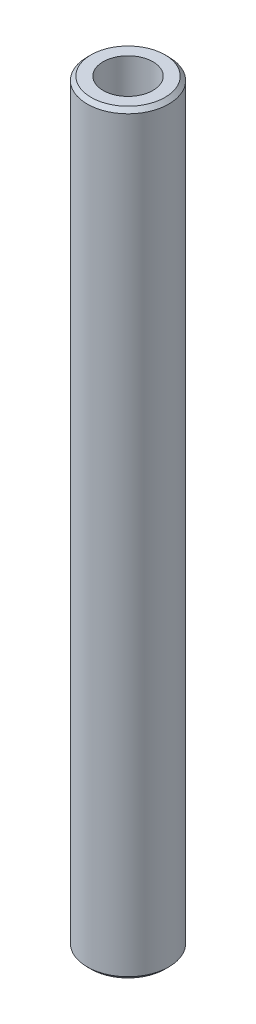
ISO-10303-21;
HEADER;
FILE_DESCRIPTION(('STEP AP214'),'2;1');
FILE_NAME('part.step','',(''),(''),'','','');
FILE_SCHEMA(('AUTOMOTIVE_DESIGN { 1 0 10303 214 1 1 1 1 }'));
ENDSEC;
DATA;
#1=APPLICATION_CONTEXT('core data for automotive mechanical design processes');
#2=APPLICATION_PROTOCOL_DEFINITION('international standard','automotive_design',2000,#1);
#3=PRODUCT_CONTEXT('',#1,'mechanical');
#4=PRODUCT('Part','Part','',(#3));
#5=PRODUCT_RELATED_PRODUCT_CATEGORY('part','',(#4));
#6=PRODUCT_DEFINITION_FORMATION('','',#4);
#7=PRODUCT_DEFINITION_CONTEXT('part definition',#1,'design');
#8=PRODUCT_DEFINITION('design','',#6,#7);
#9=PRODUCT_DEFINITION_SHAPE('','',#8);
#10=(LENGTH_UNIT() NAMED_UNIT(*) SI_UNIT(.MILLI.,.METRE.));
#11=(NAMED_UNIT(*) PLANE_ANGLE_UNIT() SI_UNIT($,.RADIAN.));
#12=(NAMED_UNIT(*) SI_UNIT($,.STERADIAN.) SOLID_ANGLE_UNIT());
#13=UNCERTAINTY_MEASURE_WITH_UNIT(LENGTH_MEASURE(1.E-05),#10,'distance_accuracy_value','');
#14=(GEOMETRIC_REPRESENTATION_CONTEXT(3) GLOBAL_UNCERTAINTY_ASSIGNED_CONTEXT((#13)) GLOBAL_UNIT_ASSIGNED_CONTEXT((#10,
#11,#12)) REPRESENTATION_CONTEXT('',''));
#15=CARTESIAN_POINT('',(0.,0.,0.));
#16=DIRECTION('',(0.,0.,1.));
#17=DIRECTION('',(1.,0.,0.));
#18=AXIS2_PLACEMENT_3D('',#15,#16,#17);
#19=CARTESIAN_POINT('',(0.,416.638164590258,0.));
#20=DIRECTION('',(0.,-1.,0.));
#21=DIRECTION('',(0.,0.,-1.));
#22=AXIS2_PLACEMENT_3D('',#19,#20,#21);
#23=CYLINDRICAL_SURFACE('',#22,22.5);
#24=CARTESIAN_POINT('',(0.,414.516048344697,0.));
#25=DIRECTION('',(0.,1.,0.));
#26=DIRECTION('',(0.,0.,1.));
#27=AXIS2_PLACEMENT_3D('',#24,#25,#26);
#28=CIRCLE('',#27,22.5);
#29=CARTESIAN_POINT('',(0.,414.516048344697,-22.5));
#30=VERTEX_POINT('',#29);
#31=EDGE_CURVE('E50',#30,#30,#28,.F.);
#32=CARTESIAN_POINT('',(0.,2.12211624556136,0.));
#33=DIRECTION('',(0.,1.,0.));
#34=DIRECTION('',(0.,0.,1.));
#35=AXIS2_PLACEMENT_3D('',#32,#33,#34);
#36=CIRCLE('',#35,22.5);
#37=CARTESIAN_POINT('',(0.,2.12211624556136,-22.5));
#38=VERTEX_POINT('',#37);
#39=EDGE_CURVE('E51',#38,#38,#36,.T.);
#40=CARTESIAN_POINT('',(0.,414.516048344697,-22.5));
#41=CARTESIAN_POINT('',(0.,410.220278218664,-22.5));
#42=CARTESIAN_POINT('',(0.,405.924508092632,-22.5));
#43=CARTESIAN_POINT('',(0.,397.332967840566,-22.5));
#44=CARTESIAN_POINT('',(0.,393.037197714534,-22.5));
#45=CARTESIAN_POINT('',(0.,384.445657462468,-22.5));
#46=CARTESIAN_POINT('',(0.,380.149887336436,-22.5));
#47=CARTESIAN_POINT('',(0.,371.55834708437,-22.5));
#48=CARTESIAN_POINT('',(0.,367.262576958338,-22.5));
#49=CARTESIAN_POINT('',(0.,358.671036706272,-22.5));
#50=CARTESIAN_POINT('',(0.,354.37526658024,-22.5));
#51=CARTESIAN_POINT('',(0.,345.783726328174,-22.5));
#52=CARTESIAN_POINT('',(0.,341.487956202142,-22.5));
#53=CARTESIAN_POINT('',(0.,332.896415950076,-22.5));
#54=CARTESIAN_POINT('',(0.,328.600645824044,-22.5));
#55=CARTESIAN_POINT('',(0.,320.009105571978,-22.5));
#56=CARTESIAN_POINT('',(0.,315.713335445946,-22.5));
#57=CARTESIAN_POINT('',(0.,307.12179519388,-22.5));
#58=CARTESIAN_POINT('',(0.,302.826025067848,-22.5));
#59=CARTESIAN_POINT('',(0.,294.234484815782,-22.5));
#60=CARTESIAN_POINT('',(0.,289.93871468975,-22.5));
#61=CARTESIAN_POINT('',(0.,281.347174437684,-22.5));
#62=CARTESIAN_POINT('',(0.,277.051404311652,-22.5));
#63=CARTESIAN_POINT('',(0.,268.459864059586,-22.5));
#64=CARTESIAN_POINT('',(0.,264.164093933554,-22.5));
#65=CARTESIAN_POINT('',(0.,255.572553681488,-22.5));
#66=CARTESIAN_POINT('',(0.,251.276783555456,-22.5));
#67=CARTESIAN_POINT('',(0.,242.685243303391,-22.5));
#68=CARTESIAN_POINT('',(0.,238.389473177358,-22.5));
#69=CARTESIAN_POINT('',(0.,229.797932925292,-22.5));
#70=CARTESIAN_POINT('',(0.,225.50216279926,-22.5));
#71=CARTESIAN_POINT('',(0.,216.910622547195,-22.5));
#72=CARTESIAN_POINT('',(0.,212.614852421162,-22.5));
#73=CARTESIAN_POINT('',(0.,204.023312169097,-22.5));
#74=CARTESIAN_POINT('',(0.,199.727542043064,-22.5));
#75=CARTESIAN_POINT('',(0.,191.136001790999,-22.5));
#76=CARTESIAN_POINT('',(0.,186.840231664966,-22.5));
#77=CARTESIAN_POINT('',(0.,178.248691412901,-22.5));
#78=CARTESIAN_POINT('',(0.,173.952921286868,-22.5));
#79=CARTESIAN_POINT('',(0.,165.361381034803,-22.5));
#80=CARTESIAN_POINT('',(0.,161.06561090877,-22.5));
#81=CARTESIAN_POINT('',(0.,152.474070656705,-22.5));
#82=CARTESIAN_POINT('',(0.,148.178300530672,-22.5));
#83=CARTESIAN_POINT('',(0.,139.586760278607,-22.5));
#84=CARTESIAN_POINT('',(0.,135.290990152574,-22.5));
#85=CARTESIAN_POINT('',(0.,126.699449900509,-22.5));
#86=CARTESIAN_POINT('',(0.,122.403679774476,-22.5));
#87=CARTESIAN_POINT('',(0.,113.812139522411,-22.5));
#88=CARTESIAN_POINT('',(0.,109.516369396378,-22.5));
#89=CARTESIAN_POINT('',(0.,100.924829144313,-22.5));
#90=CARTESIAN_POINT('',(0.,96.6290590182799,-22.5));
#91=CARTESIAN_POINT('',(0.,88.0375187662146,-22.5));
#92=CARTESIAN_POINT('',(0.,83.741748640182,-22.5));
#93=CARTESIAN_POINT('',(0.,75.1502083881167,-22.5));
#94=CARTESIAN_POINT('',(0.,70.854438262084,-22.5));
#95=CARTESIAN_POINT('',(0.,62.2628980100186,-22.5));
#96=CARTESIAN_POINT('',(0.,57.967127883986,-22.5));
#97=CARTESIAN_POINT('',(0.,49.3755876319206,-22.5));
#98=CARTESIAN_POINT('',(0.,45.079817505888,-22.5));
#99=CARTESIAN_POINT('',(0.,36.4882772538226,-22.5));
#100=CARTESIAN_POINT('',(0.,32.19250712779,-22.5));
#101=CARTESIAN_POINT('',(0.,23.6009668757247,-22.5));
#102=CARTESIAN_POINT('',(0.,19.305196749692,-22.5));
#103=CARTESIAN_POINT('',(0.,10.7136564976267,-22.5));
#104=CARTESIAN_POINT('',(0.,6.41788637159402,-22.5));
#105=CARTESIAN_POINT('',(0.,2.12211624556136,-22.5));
#106=B_SPLINE_CURVE_WITH_KNOTS('',3,(#40,#41,#42,#43,#44,#45,#46,#47,#48,#49,#50,#51,#52,#53,
#54,#55,#56,#57,#58,#59,#60,#61,#62,#63,#64,#65,#66,#67,#68,#69,#70,#71,#72,#73,#74,#75,#76,#77,
#78,#79,#80,#81,#82,#83,#84,#85,#86,#87,#88,#89,#90,#91,#92,#93,#94,#95,#96,#97,#98,#99,#100,
#101,#102,#103,#104,#105),.UNSPECIFIED.,.F.,.F.,(4,2,2,2,2,2,2,2,2,2,2,2,2,2,2,2,2,2,2,2,2,2,2,
2,2,2,2,2,2,2,2,2,4),(0.,12.887310378098,25.774620756196,38.661931134294,51.5492415123919,
64.4365518904899,77.3238622685879,90.2111726466859,103.098483024784,115.985793402882,
128.87310378098,141.760414159078,154.647724537176,167.535034915274,180.422345293372,
193.30965567147,206.196966049568,219.084276427666,231.971586805764,244.858897183862,
257.74620756196,270.633517940058,283.520828318156,296.408138696254,309.295449074352,
322.18275945245,335.070069830548,347.957380208646,360.844690586744,373.732000964842,
386.61931134294,399.506621721038,412.393932099136),.UNSPECIFIED.);
#107=EDGE_CURVE('BSEAM39',#30,#38,#106,.T.);
#108=ORIENTED_EDGE('',*,*,#31,.T.);
#109=ORIENTED_EDGE('',*,*,#39,.T.);
#110=ORIENTED_EDGE('',*,*,#107,.T.);
#111=ORIENTED_EDGE('',*,*,#107,.F.);
#112=EDGE_LOOP('',(#108,#110,#109,#111));
#113=FACE_BOUND('',#112,.T.);
#114=ADVANCED_FACE('F39',(#113),#23,.T.);
#115=CARTESIAN_POINT('',(0.,416.638164590258,0.));
#116=DIRECTION('',(0.,1.,0.));
#117=DIRECTION('',(0.,0.,1.));
#118=AXIS2_PLACEMENT_3D('',#115,#116,#117);
#119=PLANE('',#118);
#120=CARTESIAN_POINT('',(0.,416.638164590258,0.));
#121=DIRECTION('',(0.,1.,0.));
#122=DIRECTION('',(0.,0.,1.));
#123=AXIS2_PLACEMENT_3D('',#120,#121,#122);
#124=CIRCLE('',#123,20.3778837544392);
#125=CARTESIAN_POINT('',(0.,416.638164590258,20.3778837544392));
#126=VERTEX_POINT('',#125);
#127=EDGE_CURVE('E54',#126,#126,#124,.T.);
#128=ORIENTED_EDGE('',*,*,#127,.T.);
#129=EDGE_LOOP('',(#128));
#130=FACE_BOUND('',#129,.T.);
#131=CARTESIAN_POINT('',(0.,416.638164590258,0.));
#132=DIRECTION('',(0.,1.,0.));
#133=DIRECTION('',(0.,0.,1.));
#134=AXIS2_PLACEMENT_3D('',#131,#132,#133);
#135=CIRCLE('',#134,13.747466952704);
#136=CARTESIAN_POINT('',(0.,416.638164590258,-13.747466952704));
#137=VERTEX_POINT('',#136);
#138=EDGE_CURVE('E58',#137,#137,#135,.T.);
#139=ORIENTED_EDGE('',*,*,#138,.F.);
#140=EDGE_LOOP('',(#139));
#141=FACE_BOUND('',#140,.T.);
#142=ADVANCED_FACE('F69',(#130,#141),#119,.T.);
#143=CARTESIAN_POINT('',(0.,0.,0.));
#144=DIRECTION('',(0.,1.,0.));
#145=DIRECTION('',(0.,0.,1.));
#146=AXIS2_PLACEMENT_3D('',#143,#144,#145);
#147=PLANE('',#146);
#148=CARTESIAN_POINT('',(0.,0.,0.));
#149=DIRECTION('',(0.,1.,0.));
#150=DIRECTION('',(0.,0.,1.));
#151=AXIS2_PLACEMENT_3D('',#148,#149,#150);
#152=CIRCLE('',#151,20.3778837544386);
#153=CARTESIAN_POINT('',(0.,0.,20.3778837544386));
#154=VERTEX_POINT('',#153);
#155=EDGE_CURVE('E10',#154,#154,#152,.F.);
#156=ORIENTED_EDGE('',*,*,#155,.T.);
#157=EDGE_LOOP('',(#156));
#158=FACE_BOUND('',#157,.T.);
#159=CARTESIAN_POINT('',(0.,0.,0.));
#160=DIRECTION('',(0.,1.,0.));
#161=DIRECTION('',(0.,0.,1.));
#162=AXIS2_PLACEMENT_3D('',#159,#160,#161);
#163=CIRCLE('',#162,13.747466952704);
#164=CARTESIAN_POINT('',(0.,0.,-13.747466952704));
#165=VERTEX_POINT('',#164);
#166=EDGE_CURVE('E63',#165,#165,#163,.T.);
#167=ORIENTED_EDGE('',*,*,#166,.T.);
#168=EDGE_LOOP('',(#167));
#169=FACE_BOUND('',#168,.T.);
#170=ADVANCED_FACE('F75',(#158,#169),#147,.F.);
#171=CARTESIAN_POINT('',(0.,416.638164590258,0.));
#172=DIRECTION('',(0.,-1.,0.));
#173=DIRECTION('',(0.,0.,-1.));
#174=AXIS2_PLACEMENT_3D('',#171,#172,#173);
#175=CYLINDRICAL_SURFACE('',#174,13.747466952704);
#176=CARTESIAN_POINT('',(0.,416.638164590258,-13.747466952704));
#177=CARTESIAN_POINT('',(0.,412.298183709109,-13.747466952704));
#178=CARTESIAN_POINT('',(0.,407.958202827961,-13.747466952704));
#179=CARTESIAN_POINT('',(0.,399.278241065664,-13.747466952704));
#180=CARTESIAN_POINT('',(0.,394.938260184515,-13.747466952704));
#181=CARTESIAN_POINT('',(0.,386.258298422218,-13.747466952704));
#182=CARTESIAN_POINT('',(0.,381.91831754107,-13.747466952704));
#183=CARTESIAN_POINT('',(0.,373.238355778773,-13.747466952704));
#184=CARTESIAN_POINT('',(0.,368.898374897624,-13.747466952704));
#185=CARTESIAN_POINT('',(0.,360.218413135327,-13.747466952704));
#186=CARTESIAN_POINT('',(0.,355.878432254179,-13.747466952704));
#187=CARTESIAN_POINT('',(0.,347.198470491882,-13.747466952704));
#188=CARTESIAN_POINT('',(0.,342.858489610733,-13.747466952704));
#189=CARTESIAN_POINT('',(0.,334.178527848436,-13.747466952704));
#190=CARTESIAN_POINT('',(0.,329.838546967287,-13.747466952704));
#191=CARTESIAN_POINT('',(0.,321.15858520499,-13.747466952704));
#192=CARTESIAN_POINT('',(0.,316.818604323842,-13.747466952704));
#193=CARTESIAN_POINT('',(0.,308.138642561545,-13.747466952704));
#194=CARTESIAN_POINT('',(0.,303.798661680396,-13.747466952704));
#195=CARTESIAN_POINT('',(0.,295.118699918099,-13.747466952704));
#196=CARTESIAN_POINT('',(0.,290.778719036951,-13.747466952704));
#197=CARTESIAN_POINT('',(0.,282.098757274654,-13.747466952704));
#198=CARTESIAN_POINT('',(0.,277.758776393505,-13.747466952704));
#199=CARTESIAN_POINT('',(0.,269.078814631208,-13.747466952704));
#200=CARTESIAN_POINT('',(0.,264.73883375006,-13.747466952704));
#201=CARTESIAN_POINT('',(0.,256.058871987763,-13.747466952704));
#202=CARTESIAN_POINT('',(0.,251.718891106614,-13.747466952704));
#203=CARTESIAN_POINT('',(0.,243.038929344317,-13.747466952704));
#204=CARTESIAN_POINT('',(0.,238.698948463169,-13.747466952704));
#205=CARTESIAN_POINT('',(0.,230.018986700871,-13.747466952704));
#206=CARTESIAN_POINT('',(0.,225.679005819723,-13.747466952704));
#207=CARTESIAN_POINT('',(0.,216.999044057426,-13.747466952704));
#208=CARTESIAN_POINT('',(0.,212.659063176277,-13.747466952704));
#209=CARTESIAN_POINT('',(0.,203.97910141398,-13.747466952704));
#210=CARTESIAN_POINT('',(0.,199.639120532832,-13.747466952704));
#211=CARTESIAN_POINT('',(0.,190.959158770535,-13.747466952704));
#212=CARTESIAN_POINT('',(0.,186.619177889386,-13.747466952704));
#213=CARTESIAN_POINT('',(0.,177.939216127089,-13.747466952704));
#214=CARTESIAN_POINT('',(0.,173.599235245941,-13.747466952704));
#215=CARTESIAN_POINT('',(0.,164.919273483644,-13.747466952704));
#216=CARTESIAN_POINT('',(0.,160.579292602495,-13.747466952704));
#217=CARTESIAN_POINT('',(0.,151.899330840198,-13.747466952704));
#218=CARTESIAN_POINT('',(0.,147.55934995905,-13.747466952704));
#219=CARTESIAN_POINT('',(0.,138.879388196753,-13.747466952704));
#220=CARTESIAN_POINT('',(0.,134.539407315604,-13.747466952704));
#221=CARTESIAN_POINT('',(0.,125.859445553307,-13.747466952704));
#222=CARTESIAN_POINT('',(0.,121.519464672159,-13.747466952704));
#223=CARTESIAN_POINT('',(0.,112.839502909862,-13.747466952704));
#224=CARTESIAN_POINT('',(0.,108.499522028713,-13.747466952704));
#225=CARTESIAN_POINT('',(0.,99.819560266416,-13.747466952704));
#226=CARTESIAN_POINT('',(0.,95.4795793852674,-13.747466952704));
#227=CARTESIAN_POINT('',(0.,86.7996176229704,-13.747466952704));
#228=CARTESIAN_POINT('',(0.,82.4596367418219,-13.747466952704));
#229=CARTESIAN_POINT('',(0.,73.7796749795249,-13.747466952704));
#230=CARTESIAN_POINT('',(0.,69.4396940983763,-13.747466952704));
#231=CARTESIAN_POINT('',(0.,60.7597323360793,-13.747466952704));
#232=CARTESIAN_POINT('',(0.,56.4197514549307,-13.747466952704));
#233=CARTESIAN_POINT('',(0.,47.7397896926337,-13.747466952704));
#234=CARTESIAN_POINT('',(0.,43.3998088114852,-13.747466952704));
#235=CARTESIAN_POINT('',(0.,34.7198470491882,-13.747466952704));
#236=CARTESIAN_POINT('',(0.,30.3798661680396,-13.747466952704));
#237=CARTESIAN_POINT('',(0.,21.6999044057426,-13.747466952704));
#238=CARTESIAN_POINT('',(0.,17.3599235245941,-13.747466952704));
#239=CARTESIAN_POINT('',(0.,8.67996176229705,-13.747466952704));
#240=CARTESIAN_POINT('',(0.,4.33998088114852,-13.747466952704));
#241=CARTESIAN_POINT('',(0.,0.,-13.747466952704));
#242=B_SPLINE_CURVE_WITH_KNOTS('',3,(#176,#177,#178,#179,#180,#181,#182,#183,#184,#185,#186,
#187,#188,#189,#190,#191,#192,#193,#194,#195,#196,#197,#198,#199,#200,#201,#202,#203,#204,#205,
#206,#207,#208,#209,#210,#211,#212,#213,#214,#215,#216,#217,#218,#219,#220,#221,#222,#223,#224,
#225,#226,#227,#228,#229,#230,#231,#232,#233,#234,#235,#236,#237,#238,#239,#240,#241),
.UNSPECIFIED.,.F.,.F.,(4,2,2,2,2,2,2,2,2,2,2,2,2,2,2,2,2,2,2,2,2,2,2,2,2,2,2,2,2,2,2,2,4),(0.,
13.0199426434456,26.0398852868912,39.0598279303367,52.0797705737823,65.0997132172278,
78.1196558606734,91.139598504119,104.159541147564,117.17948379101,130.199426434456,
143.219369077901,156.239311721347,169.259254364792,182.279197008238,195.299139651683,
208.319082295129,221.339024938575,234.35896758202,247.378910225466,260.398852868911,
273.418795512357,286.438738155802,299.458680799248,312.478623442693,325.498566086139,
338.518508729584,351.53845137303,364.558394016476,377.578336659921,390.598279303367,
403.618221946812,416.638164590258),.UNSPECIFIED.);
#243=EDGE_CURVE('BSEAM70',#137,#165,#242,.T.);
#244=ORIENTED_EDGE('',*,*,#138,.T.);
#245=ORIENTED_EDGE('',*,*,#166,.F.);
#246=ORIENTED_EDGE('',*,*,#243,.T.);
#247=ORIENTED_EDGE('',*,*,#243,.F.);
#248=EDGE_LOOP('',(#244,#246,#245,#247));
#249=FACE_BOUND('',#248,.T.);
#250=ADVANCED_FACE('F70',(#249),#175,.F.);
#251=CARTESIAN_POINT('',(0.,416.638164590258,0.));
#252=DIRECTION('',(0.,-1.,0.));
#253=DIRECTION('',(0.,0.,-1.));
#254=AXIS2_PLACEMENT_3D('',#251,#252,#253);
#255=CONICAL_SURFACE('',#254,20.3778837544392,0.785398163397445);
#256=ORIENTED_EDGE('',*,*,#31,.F.);
#257=EDGE_LOOP('',(#256));
#258=FACE_BOUND('',#257,.T.);
#259=ORIENTED_EDGE('',*,*,#127,.F.);
#260=EDGE_LOOP('',(#259));
#261=FACE_BOUND('',#260,.T.);
#262=ADVANCED_FACE('F81',(#258,#261),#255,.T.);
#263=CARTESIAN_POINT('',(0.,2.12211624556136,0.));
#264=DIRECTION('',(0.,1.,0.));
#265=DIRECTION('',(0.,0.,1.));
#266=AXIS2_PLACEMENT_3D('',#263,#264,#265);
#267=CONICAL_SURFACE('',#266,22.5,0.785398163397458);
#268=ORIENTED_EDGE('',*,*,#155,.F.);
#269=EDGE_LOOP('',(#268));
#270=FACE_BOUND('',#269,.T.);
#271=ORIENTED_EDGE('',*,*,#39,.F.);
#272=EDGE_LOOP('',(#271));
#273=FACE_BOUND('',#272,.T.);
#274=ADVANCED_FACE('F45',(#270,#273),#267,.T.);
#275=CLOSED_SHELL('',(#114,#142,#170,#250,#262,#274));
#276=MANIFOLD_SOLID_BREP('B2',#275);
#277=ADVANCED_BREP_SHAPE_REPRESENTATION('',(#18,#276),#14);
#278=SHAPE_DEFINITION_REPRESENTATION(#9,#277);
ENDSEC;
END-ISO-10303-21;
